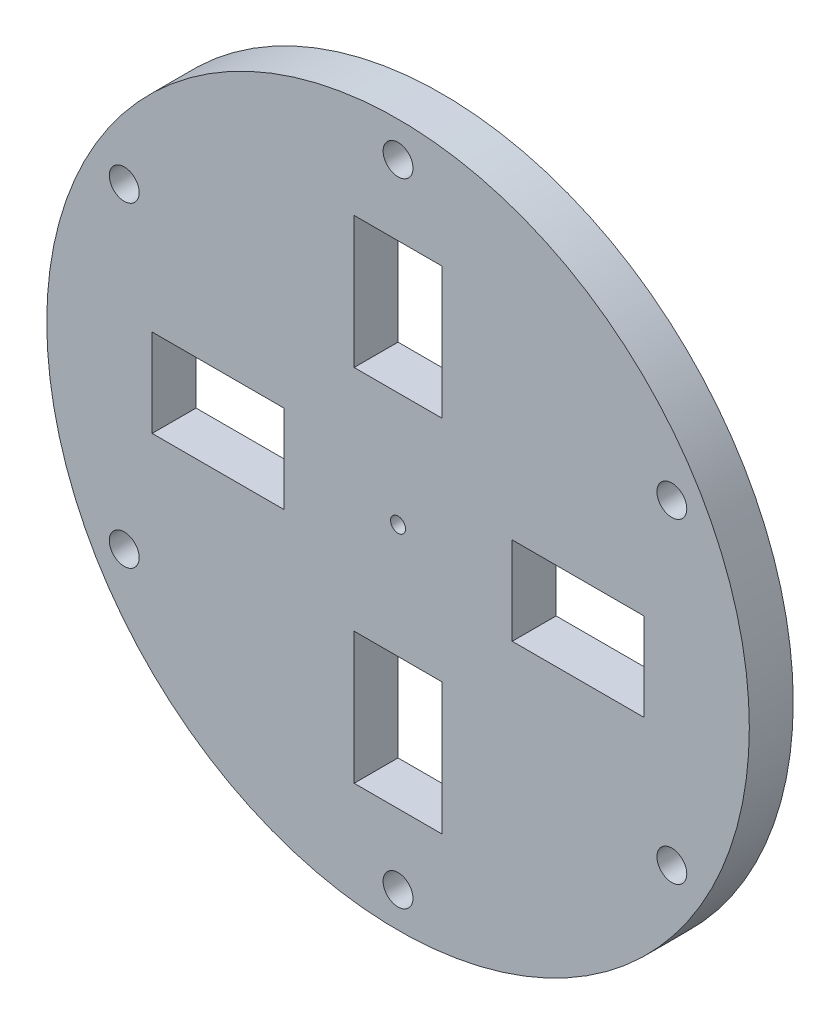
ISO-10303-21;
HEADER;
FILE_DESCRIPTION(('STEP AP214'),'2;1');
FILE_NAME('part.step','',(''),(''),'','','');
FILE_SCHEMA(('AUTOMOTIVE_DESIGN { 1 0 10303 214 1 1 1 1 }'));
ENDSEC;
DATA;
#1=APPLICATION_CONTEXT('core data for automotive mechanical design processes');
#2=APPLICATION_PROTOCOL_DEFINITION('international standard','automotive_design',2000,#1);
#3=PRODUCT_CONTEXT('',#1,'mechanical');
#4=PRODUCT('Part','Part','',(#3));
#5=PRODUCT_RELATED_PRODUCT_CATEGORY('part','',(#4));
#6=PRODUCT_DEFINITION_FORMATION('','',#4);
#7=PRODUCT_DEFINITION_CONTEXT('part definition',#1,'design');
#8=PRODUCT_DEFINITION('design','',#6,#7);
#9=PRODUCT_DEFINITION_SHAPE('','',#8);
#10=(LENGTH_UNIT() NAMED_UNIT(*) SI_UNIT(.MILLI.,.METRE.));
#11=(NAMED_UNIT(*) PLANE_ANGLE_UNIT() SI_UNIT($,.RADIAN.));
#12=(NAMED_UNIT(*) SI_UNIT($,.STERADIAN.) SOLID_ANGLE_UNIT());
#13=UNCERTAINTY_MEASURE_WITH_UNIT(LENGTH_MEASURE(1.E-05),#10,'distance_accuracy_value','');
#14=(GEOMETRIC_REPRESENTATION_CONTEXT(3) GLOBAL_UNCERTAINTY_ASSIGNED_CONTEXT((#13)) GLOBAL_UNIT_ASSIGNED_CONTEXT((#10,
#11,#12)) REPRESENTATION_CONTEXT('',''));
#15=CARTESIAN_POINT('',(0.,0.,0.));
#16=DIRECTION('',(0.,0.,1.));
#17=DIRECTION('',(1.,0.,0.));
#18=AXIS2_PLACEMENT_3D('',#15,#16,#17);
#19=CARTESIAN_POINT('',(0.,0.,5.));
#20=DIRECTION('',(0.,0.,1.));
#21=DIRECTION('',(1.,0.,0.));
#22=AXIS2_PLACEMENT_3D('',#19,#20,#21);
#23=PLANE('',#22);
#24=CARTESIAN_POINT('',(0.,0.,5.));
#25=DIRECTION('',(0.,0.,1.));
#26=DIRECTION('',(1.,0.,0.));
#27=AXIS2_PLACEMENT_3D('',#24,#25,#26);
#28=CIRCLE('',#27,0.85);
#29=CARTESIAN_POINT('',(0.85,0.,5.));
#30=VERTEX_POINT('',#29);
#31=EDGE_CURVE('E402',#30,#30,#28,.T.);
#32=ORIENTED_EDGE('',*,*,#31,.F.);
#33=EDGE_LOOP('',(#32));
#34=FACE_BOUND('',#33,.T.);
#35=CARTESIAN_POINT('',(-31.1769145362396,18.0000000000004,5.));
#36=DIRECTION('',(0.,0.,1.));
#37=DIRECTION('',(1.,0.,0.));
#38=AXIS2_PLACEMENT_3D('',#35,#36,#37);
#39=CIRCLE('',#38,1.7);
#40=CARTESIAN_POINT('',(-29.4769145362396,18.0000000000004,5.));
#41=VERTEX_POINT('',#40);
#42=EDGE_CURVE('E404',#41,#41,#39,.T.);
#43=ORIENTED_EDGE('',*,*,#42,.F.);
#44=EDGE_LOOP('',(#43));
#45=FACE_BOUND('',#44,.T.);
#46=CARTESIAN_POINT('',(-31.17691453624,-17.9999999999997,5.));
#47=DIRECTION('',(0.,0.,1.));
#48=DIRECTION('',(1.,0.,0.));
#49=AXIS2_PLACEMENT_3D('',#46,#47,#48);
#50=CIRCLE('',#49,1.7);
#51=CARTESIAN_POINT('',(-29.47691453624,-17.9999999999997,5.));
#52=VERTEX_POINT('',#51);
#53=EDGE_CURVE('E410',#52,#52,#50,.T.);
#54=ORIENTED_EDGE('',*,*,#53,.F.);
#55=EDGE_LOOP('',(#54));
#56=FACE_BOUND('',#55,.T.);
#57=CARTESIAN_POINT('',(-2.51386656396706E-13,-36.,5.));
#58=DIRECTION('',(0.,0.,1.));
#59=DIRECTION('',(1.,0.,0.));
#60=AXIS2_PLACEMENT_3D('',#57,#58,#59);
#61=CIRCLE('',#60,1.7);
#62=CARTESIAN_POINT('',(1.69999999999975,-36.,5.));
#63=VERTEX_POINT('',#62);
#64=EDGE_CURVE('E416',#63,#63,#61,.T.);
#65=ORIENTED_EDGE('',*,*,#64,.F.);
#66=EDGE_LOOP('',(#65));
#67=FACE_BOUND('',#66,.T.);
#68=CARTESIAN_POINT('',(31.1769145362397,-18.0000000000002,5.));
#69=DIRECTION('',(0.,0.,1.));
#70=DIRECTION('',(1.,0.,0.));
#71=AXIS2_PLACEMENT_3D('',#68,#69,#70);
#72=CIRCLE('',#71,1.7);
#73=CARTESIAN_POINT('',(32.8769145362397,-18.0000000000002,5.));
#74=VERTEX_POINT('',#73);
#75=EDGE_CURVE('E422',#74,#74,#72,.T.);
#76=ORIENTED_EDGE('',*,*,#75,.F.);
#77=EDGE_LOOP('',(#76));
#78=FACE_BOUND('',#77,.T.);
#79=CARTESIAN_POINT('',(31.1769145362398,17.9999999999999,5.));
#80=DIRECTION('',(0.,0.,1.));
#81=DIRECTION('',(1.,0.,0.));
#82=AXIS2_PLACEMENT_3D('',#79,#80,#81);
#83=CIRCLE('',#82,1.7);
#84=CARTESIAN_POINT('',(32.8769145362398,17.9999999999999,5.));
#85=VERTEX_POINT('',#84);
#86=EDGE_CURVE('E428',#85,#85,#83,.T.);
#87=ORIENTED_EDGE('',*,*,#86,.F.);
#88=EDGE_LOOP('',(#87));
#89=FACE_BOUND('',#88,.T.);
#90=CARTESIAN_POINT('',(0.,36.,5.));
#91=DIRECTION('',(0.,0.,1.));
#92=DIRECTION('',(1.,0.,0.));
#93=AXIS2_PLACEMENT_3D('',#90,#91,#92);
#94=CIRCLE('',#93,1.7);
#95=CARTESIAN_POINT('',(1.7,36.,5.));
#96=VERTEX_POINT('',#95);
#97=EDGE_CURVE('E169',#96,#96,#94,.T.);
#98=ORIENTED_EDGE('',*,*,#97,.F.);
#99=EDGE_LOOP('',(#98));
#100=FACE_BOUND('',#99,.T.);
#101=DIRECTION('',(-1.,0.,0.));
#102=VECTOR('',#101,1.);
#103=CARTESIAN_POINT('',(-28.0000000000008,4.99999999999942,5.));
#104=LINE('',#103,#102);
#105=CARTESIAN_POINT('',(-13.0000000000008,4.99999999999942,5.));
#106=VERTEX_POINT('',#105);
#107=CARTESIAN_POINT('',(-28.0000000000008,4.99999999999942,5.));
#108=VERTEX_POINT('',#107);
#109=EDGE_CURVE('E47',#106,#108,#104,.T.);
#110=ORIENTED_EDGE('',*,*,#109,.F.);
#111=DIRECTION('',(0.,1.,0.));
#112=VECTOR('',#111,1.);
#113=CARTESIAN_POINT('',(-13.0000000000008,-4.99999999999907,5.));
#114=LINE('',#113,#112);
#115=CARTESIAN_POINT('',(-13.0000000000008,-4.99999999999907,5.));
#116=VERTEX_POINT('',#115);
#117=EDGE_CURVE('E163',#116,#106,#114,.T.);
#118=ORIENTED_EDGE('',*,*,#117,.F.);
#119=DIRECTION('',(1.,1.00787433954252E-13,0.));
#120=VECTOR('',#119,1.);
#121=CARTESIAN_POINT('',(-28.0000000000008,-5.00000000000058,5.));
#122=LINE('',#121,#120);
#123=CARTESIAN_POINT('',(-28.0000000000008,-5.00000000000058,5.));
#124=VERTEX_POINT('',#123);
#125=EDGE_CURVE('E166',#124,#116,#122,.T.);
#126=ORIENTED_EDGE('',*,*,#125,.F.);
#127=DIRECTION('',(0.,-1.,0.));
#128=VECTOR('',#127,1.);
#129=CARTESIAN_POINT('',(-28.0000000000008,-5.00000000000058,5.));
#130=LINE('',#129,#128);
#131=EDGE_CURVE('E175',#108,#124,#130,.T.);
#132=ORIENTED_EDGE('',*,*,#131,.F.);
#133=EDGE_LOOP('',(#110,#118,#126,#132));
#134=FACE_BOUND('',#133,.T.);
#135=DIRECTION('',(0.,-1.,0.));
#136=VECTOR('',#135,1.);
#137=CARTESIAN_POINT('',(-5.00000000000018,-28.0000000000007,5.));
#138=LINE('',#137,#136);
#139=CARTESIAN_POINT('',(-5.00000000000018,-13.0000000000007,5.));
#140=VERTEX_POINT('',#139);
#141=CARTESIAN_POINT('',(-5.00000000000018,-28.0000000000007,5.));
#142=VERTEX_POINT('',#141);
#143=EDGE_CURVE('E182',#140,#142,#138,.T.);
#144=ORIENTED_EDGE('',*,*,#143,.F.);
#145=DIRECTION('',(-1.,0.,0.));
#146=VECTOR('',#145,1.);
#147=CARTESIAN_POINT('',(4.99999999999831,-13.0000000000007,5.));
#148=LINE('',#147,#146);
#149=CARTESIAN_POINT('',(4.99999999999831,-13.0000000000007,5.));
#150=VERTEX_POINT('',#149);
#151=EDGE_CURVE('E190',#150,#140,#148,.T.);
#152=ORIENTED_EDGE('',*,*,#151,.F.);
#153=DIRECTION('',(-1.0096090630185E-13,1.,0.));
#154=VECTOR('',#153,1.);
#155=CARTESIAN_POINT('',(4.99999999999982,-28.0000000000007,5.));
#156=LINE('',#155,#154);
#157=CARTESIAN_POINT('',(4.99999999999982,-28.0000000000007,5.));
#158=VERTEX_POINT('',#157);
#159=EDGE_CURVE('E204',#158,#150,#156,.T.);
#160=ORIENTED_EDGE('',*,*,#159,.F.);
#161=DIRECTION('',(1.,0.,0.));
#162=VECTOR('',#161,1.);
#163=CARTESIAN_POINT('',(4.99999999999982,-28.0000000000007,5.));
#164=LINE('',#163,#162);
#165=EDGE_CURVE('E201',#142,#158,#164,.T.);
#166=ORIENTED_EDGE('',*,*,#165,.F.);
#167=EDGE_LOOP('',(#144,#152,#160,#166));
#168=FACE_BOUND('',#167,.T.);
#169=DIRECTION('',(1.,0.,0.));
#170=VECTOR('',#169,1.);
#171=CARTESIAN_POINT('',(28.,-5.00000000000013,5.));
#172=LINE('',#171,#170);
#173=CARTESIAN_POINT('',(13.,-5.00000000000014,5.));
#174=VERTEX_POINT('',#173);
#175=CARTESIAN_POINT('',(28.,-5.00000000000013,5.));
#176=VERTEX_POINT('',#175);
#177=EDGE_CURVE('E211',#174,#176,#172,.T.);
#178=ORIENTED_EDGE('',*,*,#177,.F.);
#179=DIRECTION('',(0.,-1.,0.));
#180=VECTOR('',#179,1.);
#181=CARTESIAN_POINT('',(12.9999999999999,4.99999999999836,5.));
#182=LINE('',#181,#180);
#183=CARTESIAN_POINT('',(12.9999999999999,4.99999999999836,5.));
#184=VERTEX_POINT('',#183);
#185=EDGE_CURVE('E222',#184,#174,#182,.T.);
#186=ORIENTED_EDGE('',*,*,#185,.F.);
#187=DIRECTION('',(-1.,-1.00903082185984E-13,0.));
#188=VECTOR('',#187,1.);
#189=CARTESIAN_POINT('',(28.,4.99999999999987,5.));
#190=LINE('',#189,#188);
#191=CARTESIAN_POINT('',(28.,4.99999999999987,5.));
#192=VERTEX_POINT('',#191);
#193=EDGE_CURVE('E236',#192,#184,#190,.T.);
#194=ORIENTED_EDGE('',*,*,#193,.F.);
#195=DIRECTION('',(0.,1.,0.));
#196=VECTOR('',#195,1.);
#197=CARTESIAN_POINT('',(28.,4.99999999999987,5.));
#198=LINE('',#197,#196);
#199=EDGE_CURVE('E233',#176,#192,#198,.T.);
#200=ORIENTED_EDGE('',*,*,#199,.F.);
#201=EDGE_LOOP('',(#178,#186,#194,#200));
#202=FACE_BOUND('',#201,.T.);
#203=DIRECTION('',(0.,1.,0.));
#204=VECTOR('',#203,1.);
#205=CARTESIAN_POINT('',(4.99999999999937,28.,5.));
#206=LINE('',#205,#204);
#207=CARTESIAN_POINT('',(4.99999999999937,13.,5.));
#208=VERTEX_POINT('',#207);
#209=CARTESIAN_POINT('',(4.99999999999937,28.,5.));
#210=VERTEX_POINT('',#209);
#211=EDGE_CURVE('E243',#208,#210,#206,.T.);
#212=ORIENTED_EDGE('',*,*,#211,.F.);
#213=DIRECTION('',(1.,0.,0.));
#214=VECTOR('',#213,1.);
#215=CARTESIAN_POINT('',(-4.99999999999912,13.,5.));
#216=LINE('',#215,#214);
#217=CARTESIAN_POINT('',(-4.99999999999912,13.,5.));
#218=VERTEX_POINT('',#217);
#219=EDGE_CURVE('E254',#218,#208,#216,.T.);
#220=ORIENTED_EDGE('',*,*,#219,.F.);
#221=DIRECTION('',(1.00845258070118E-13,-1.,0.));
#222=VECTOR('',#221,1.);
#223=CARTESIAN_POINT('',(-5.00000000000063,28.,5.));
#224=LINE('',#223,#222);
#225=CARTESIAN_POINT('',(-5.00000000000063,28.,5.));
#226=VERTEX_POINT('',#225);
#227=EDGE_CURVE('E268',#226,#218,#224,.T.);
#228=ORIENTED_EDGE('',*,*,#227,.F.);
#229=DIRECTION('',(-1.,0.,0.));
#230=VECTOR('',#229,1.);
#231=CARTESIAN_POINT('',(-5.00000000000063,28.,5.));
#232=LINE('',#231,#230);
#233=EDGE_CURVE('E265',#210,#226,#232,.T.);
#234=ORIENTED_EDGE('',*,*,#233,.F.);
#235=EDGE_LOOP('',(#212,#220,#228,#234));
#236=FACE_BOUND('',#235,.T.);
#237=CARTESIAN_POINT('',(0.,0.,5.));
#238=DIRECTION('',(0.,0.,1.));
#239=DIRECTION('',(1.,0.,0.));
#240=AXIS2_PLACEMENT_3D('',#237,#238,#239);
#241=CIRCLE('',#240,40.);
#242=CARTESIAN_POINT('',(40.,0.,5.));
#243=VERTEX_POINT('',#242);
#244=EDGE_CURVE('E11',#243,#243,#241,.T.);
#245=ORIENTED_EDGE('',*,*,#244,.T.);
#246=EDGE_LOOP('',(#245));
#247=FACE_BOUND('',#246,.T.);
#248=ADVANCED_FACE('F32',(#34,#45,#56,#67,#78,#89,#100,#134,#168,#202,#236,#247),#23,.T.);
#249=CARTESIAN_POINT('',(0.,0.,0.));
#250=DIRECTION('',(0.,0.,1.));
#251=DIRECTION('',(1.,0.,0.));
#252=AXIS2_PLACEMENT_3D('',#249,#250,#251);
#253=PLANE('',#252);
#254=CARTESIAN_POINT('',(0.,0.,0.));
#255=DIRECTION('',(0.,0.,1.));
#256=DIRECTION('',(1.,0.,0.));
#257=AXIS2_PLACEMENT_3D('',#254,#255,#256);
#258=CIRCLE('',#257,0.85);
#259=CARTESIAN_POINT('',(0.85,0.,0.));
#260=VERTEX_POINT('',#259);
#261=EDGE_CURVE('E400',#260,#260,#258,.T.);
#262=ORIENTED_EDGE('',*,*,#261,.T.);
#263=EDGE_LOOP('',(#262));
#264=FACE_BOUND('',#263,.T.);
#265=CARTESIAN_POINT('',(-31.1769145362396,18.0000000000004,0.));
#266=DIRECTION('',(0.,0.,1.));
#267=DIRECTION('',(1.,0.,0.));
#268=AXIS2_PLACEMENT_3D('',#265,#266,#267);
#269=CIRCLE('',#268,1.7);
#270=CARTESIAN_POINT('',(-29.4769145362396,18.0000000000004,0.));
#271=VERTEX_POINT('',#270);
#272=EDGE_CURVE('E407',#271,#271,#269,.T.);
#273=ORIENTED_EDGE('',*,*,#272,.T.);
#274=EDGE_LOOP('',(#273));
#275=FACE_BOUND('',#274,.T.);
#276=CARTESIAN_POINT('',(-31.17691453624,-17.9999999999997,0.));
#277=DIRECTION('',(0.,0.,1.));
#278=DIRECTION('',(1.,0.,0.));
#279=AXIS2_PLACEMENT_3D('',#276,#277,#278);
#280=CIRCLE('',#279,1.7);
#281=CARTESIAN_POINT('',(-29.47691453624,-17.9999999999997,0.));
#282=VERTEX_POINT('',#281);
#283=EDGE_CURVE('E413',#282,#282,#280,.T.);
#284=ORIENTED_EDGE('',*,*,#283,.T.);
#285=EDGE_LOOP('',(#284));
#286=FACE_BOUND('',#285,.T.);
#287=CARTESIAN_POINT('',(-2.51386656396706E-13,-36.,0.));
#288=DIRECTION('',(0.,0.,1.));
#289=DIRECTION('',(1.,0.,0.));
#290=AXIS2_PLACEMENT_3D('',#287,#288,#289);
#291=CIRCLE('',#290,1.7);
#292=CARTESIAN_POINT('',(1.69999999999975,-36.,0.));
#293=VERTEX_POINT('',#292);
#294=EDGE_CURVE('E419',#293,#293,#291,.T.);
#295=ORIENTED_EDGE('',*,*,#294,.T.);
#296=EDGE_LOOP('',(#295));
#297=FACE_BOUND('',#296,.T.);
#298=CARTESIAN_POINT('',(31.1769145362397,-18.0000000000002,0.));
#299=DIRECTION('',(0.,0.,1.));
#300=DIRECTION('',(1.,0.,0.));
#301=AXIS2_PLACEMENT_3D('',#298,#299,#300);
#302=CIRCLE('',#301,1.7);
#303=CARTESIAN_POINT('',(32.8769145362397,-18.0000000000002,0.));
#304=VERTEX_POINT('',#303);
#305=EDGE_CURVE('E425',#304,#304,#302,.T.);
#306=ORIENTED_EDGE('',*,*,#305,.T.);
#307=EDGE_LOOP('',(#306));
#308=FACE_BOUND('',#307,.T.);
#309=CARTESIAN_POINT('',(31.1769145362398,17.9999999999999,0.));
#310=DIRECTION('',(0.,0.,1.));
#311=DIRECTION('',(1.,0.,0.));
#312=AXIS2_PLACEMENT_3D('',#309,#310,#311);
#313=CIRCLE('',#312,1.7);
#314=CARTESIAN_POINT('',(32.8769145362398,17.9999999999999,0.));
#315=VERTEX_POINT('',#314);
#316=EDGE_CURVE('E431',#315,#315,#313,.T.);
#317=ORIENTED_EDGE('',*,*,#316,.T.);
#318=EDGE_LOOP('',(#317));
#319=FACE_BOUND('',#318,.T.);
#320=CARTESIAN_POINT('',(0.,36.,0.));
#321=DIRECTION('',(0.,0.,1.));
#322=DIRECTION('',(1.,0.,0.));
#323=AXIS2_PLACEMENT_3D('',#320,#321,#322);
#324=CIRCLE('',#323,1.7);
#325=CARTESIAN_POINT('',(1.7,36.,0.));
#326=VERTEX_POINT('',#325);
#327=EDGE_CURVE('E176',#326,#326,#324,.T.);
#328=ORIENTED_EDGE('',*,*,#327,.T.);
#329=EDGE_LOOP('',(#328));
#330=FACE_BOUND('',#329,.T.);
#331=DIRECTION('',(0.,1.,0.));
#332=VECTOR('',#331,1.);
#333=CARTESIAN_POINT('',(-13.0000000000008,-4.99999999999907,0.));
#334=LINE('',#333,#332);
#335=CARTESIAN_POINT('',(-13.0000000000008,-4.99999999999907,0.));
#336=VERTEX_POINT('',#335);
#337=CARTESIAN_POINT('',(-13.0000000000008,4.99999999999942,0.));
#338=VERTEX_POINT('',#337);
#339=EDGE_CURVE('E153',#336,#338,#334,.T.);
#340=ORIENTED_EDGE('',*,*,#339,.T.);
#341=DIRECTION('',(-1.,0.,0.));
#342=VECTOR('',#341,1.);
#343=CARTESIAN_POINT('',(-28.0000000000008,4.99999999999942,0.));
#344=LINE('',#343,#342);
#345=CARTESIAN_POINT('',(-28.0000000000008,4.99999999999942,0.));
#346=VERTEX_POINT('',#345);
#347=EDGE_CURVE('E147',#338,#346,#344,.T.);
#348=ORIENTED_EDGE('',*,*,#347,.T.);
#349=DIRECTION('',(0.,-1.,0.));
#350=VECTOR('',#349,1.);
#351=CARTESIAN_POINT('',(-28.0000000000008,-5.00000000000058,0.));
#352=LINE('',#351,#350);
#353=CARTESIAN_POINT('',(-28.0000000000008,-5.00000000000058,0.));
#354=VERTEX_POINT('',#353);
#355=EDGE_CURVE('E156',#346,#354,#352,.T.);
#356=ORIENTED_EDGE('',*,*,#355,.T.);
#357=DIRECTION('',(1.,1.00787433954252E-13,0.));
#358=VECTOR('',#357,1.);
#359=CARTESIAN_POINT('',(-28.0000000000008,-5.00000000000058,0.));
#360=LINE('',#359,#358);
#361=EDGE_CURVE('E55',#354,#336,#360,.T.);
#362=ORIENTED_EDGE('',*,*,#361,.T.);
#363=EDGE_LOOP('',(#340,#348,#356,#362));
#364=FACE_BOUND('',#363,.T.);
#365=DIRECTION('',(-1.,0.,0.));
#366=VECTOR('',#365,1.);
#367=CARTESIAN_POINT('',(4.99999999999831,-13.0000000000007,0.));
#368=LINE('',#367,#366);
#369=CARTESIAN_POINT('',(4.99999999999831,-13.0000000000007,0.));
#370=VERTEX_POINT('',#369);
#371=CARTESIAN_POINT('',(-5.00000000000018,-13.0000000000007,0.));
#372=VERTEX_POINT('',#371);
#373=EDGE_CURVE('E196',#370,#372,#368,.T.);
#374=ORIENTED_EDGE('',*,*,#373,.T.);
#375=DIRECTION('',(0.,-1.,0.));
#376=VECTOR('',#375,1.);
#377=CARTESIAN_POINT('',(-5.00000000000018,-28.0000000000007,0.));
#378=LINE('',#377,#376);
#379=CARTESIAN_POINT('',(-5.00000000000018,-28.0000000000007,0.));
#380=VERTEX_POINT('',#379);
#381=EDGE_CURVE('E186',#372,#380,#378,.T.);
#382=ORIENTED_EDGE('',*,*,#381,.T.);
#383=DIRECTION('',(1.,0.,0.));
#384=VECTOR('',#383,1.);
#385=CARTESIAN_POINT('',(4.99999999999982,-28.0000000000007,0.));
#386=LINE('',#385,#384);
#387=CARTESIAN_POINT('',(4.99999999999982,-28.0000000000007,0.));
#388=VERTEX_POINT('',#387);
#389=EDGE_CURVE('E189',#380,#388,#386,.T.);
#390=ORIENTED_EDGE('',*,*,#389,.T.);
#391=DIRECTION('',(-1.0096090630185E-13,1.,0.));
#392=VECTOR('',#391,1.);
#393=CARTESIAN_POINT('',(4.99999999999982,-28.0000000000007,0.));
#394=LINE('',#393,#392);
#395=EDGE_CURVE('E193',#388,#370,#394,.T.);
#396=ORIENTED_EDGE('',*,*,#395,.T.);
#397=EDGE_LOOP('',(#374,#382,#390,#396));
#398=FACE_BOUND('',#397,.T.);
#399=DIRECTION('',(0.,-1.,0.));
#400=VECTOR('',#399,1.);
#401=CARTESIAN_POINT('',(12.9999999999999,4.99999999999836,0.));
#402=LINE('',#401,#400);
#403=CARTESIAN_POINT('',(12.9999999999999,4.99999999999836,0.));
#404=VERTEX_POINT('',#403);
#405=CARTESIAN_POINT('',(13.,-5.00000000000014,0.));
#406=VERTEX_POINT('',#405);
#407=EDGE_CURVE('E228',#404,#406,#402,.T.);
#408=ORIENTED_EDGE('',*,*,#407,.T.);
#409=DIRECTION('',(1.,0.,0.));
#410=VECTOR('',#409,1.);
#411=CARTESIAN_POINT('',(28.,-5.00000000000013,0.));
#412=LINE('',#411,#410);
#413=CARTESIAN_POINT('',(28.,-5.00000000000013,0.));
#414=VERTEX_POINT('',#413);
#415=EDGE_CURVE('E218',#406,#414,#412,.T.);
#416=ORIENTED_EDGE('',*,*,#415,.T.);
#417=DIRECTION('',(0.,1.,0.));
#418=VECTOR('',#417,1.);
#419=CARTESIAN_POINT('',(28.,4.99999999999987,0.));
#420=LINE('',#419,#418);
#421=CARTESIAN_POINT('',(28.,4.99999999999987,0.));
#422=VERTEX_POINT('',#421);
#423=EDGE_CURVE('E221',#414,#422,#420,.T.);
#424=ORIENTED_EDGE('',*,*,#423,.T.);
#425=DIRECTION('',(-1.,-1.00903082185984E-13,0.));
#426=VECTOR('',#425,1.);
#427=CARTESIAN_POINT('',(28.,4.99999999999987,0.));
#428=LINE('',#427,#426);
#429=EDGE_CURVE('E225',#422,#404,#428,.T.);
#430=ORIENTED_EDGE('',*,*,#429,.T.);
#431=EDGE_LOOP('',(#408,#416,#424,#430));
#432=FACE_BOUND('',#431,.T.);
#433=DIRECTION('',(1.,0.,0.));
#434=VECTOR('',#433,1.);
#435=CARTESIAN_POINT('',(-4.99999999999912,13.,0.));
#436=LINE('',#435,#434);
#437=CARTESIAN_POINT('',(-4.99999999999912,13.,0.));
#438=VERTEX_POINT('',#437);
#439=CARTESIAN_POINT('',(4.99999999999937,13.,0.));
#440=VERTEX_POINT('',#439);
#441=EDGE_CURVE('E260',#438,#440,#436,.T.);
#442=ORIENTED_EDGE('',*,*,#441,.T.);
#443=DIRECTION('',(0.,1.,0.));
#444=VECTOR('',#443,1.);
#445=CARTESIAN_POINT('',(4.99999999999937,28.,0.));
#446=LINE('',#445,#444);
#447=CARTESIAN_POINT('',(4.99999999999937,28.,0.));
#448=VERTEX_POINT('',#447);
#449=EDGE_CURVE('E250',#440,#448,#446,.T.);
#450=ORIENTED_EDGE('',*,*,#449,.T.);
#451=DIRECTION('',(-1.,0.,0.));
#452=VECTOR('',#451,1.);
#453=CARTESIAN_POINT('',(-5.00000000000063,28.,0.));
#454=LINE('',#453,#452);
#455=CARTESIAN_POINT('',(-5.00000000000063,28.,0.));
#456=VERTEX_POINT('',#455);
#457=EDGE_CURVE('E253',#448,#456,#454,.T.);
#458=ORIENTED_EDGE('',*,*,#457,.T.);
#459=DIRECTION('',(1.00845258070118E-13,-1.,0.));
#460=VECTOR('',#459,1.);
#461=CARTESIAN_POINT('',(-5.00000000000063,28.,0.));
#462=LINE('',#461,#460);
#463=EDGE_CURVE('E257',#456,#438,#462,.T.);
#464=ORIENTED_EDGE('',*,*,#463,.T.);
#465=EDGE_LOOP('',(#442,#450,#458,#464));
#466=FACE_BOUND('',#465,.T.);
#467=CARTESIAN_POINT('',(0.,0.,0.));
#468=DIRECTION('',(0.,0.,1.));
#469=DIRECTION('',(1.,0.,0.));
#470=AXIS2_PLACEMENT_3D('',#467,#468,#469);
#471=CIRCLE('',#470,40.);
#472=CARTESIAN_POINT('',(40.,0.,0.));
#473=VERTEX_POINT('',#472);
#474=EDGE_CURVE('E36',#473,#473,#471,.T.);
#475=ORIENTED_EDGE('',*,*,#474,.F.);
#476=EDGE_LOOP('',(#475));
#477=FACE_BOUND('',#476,.T.);
#478=ADVANCED_FACE('F160',(#264,#275,#286,#297,#308,#319,#330,#364,#398,#432,#466,#477),#253,.F.);
#479=CARTESIAN_POINT('',(0.,0.,5.));
#480=DIRECTION('',(0.,0.,-1.));
#481=DIRECTION('',(-1.,0.,0.));
#482=AXIS2_PLACEMENT_3D('',#479,#480,#481);
#483=CYLINDRICAL_SURFACE('',#482,40.);
#484=ORIENTED_EDGE('',*,*,#244,.F.);
#485=EDGE_LOOP('',(#484));
#486=FACE_BOUND('',#485,.T.);
#487=ORIENTED_EDGE('',*,*,#474,.T.);
#488=EDGE_LOOP('',(#487));
#489=FACE_BOUND('',#488,.T.);
#490=ADVANCED_FACE('F34',(#486,#489),#483,.T.);
#491=CARTESIAN_POINT('',(4.99999999999937,28.,0.));
#492=DIRECTION('',(1.,0.,0.));
#493=DIRECTION('',(0.,1.,0.));
#494=AXIS2_PLACEMENT_3D('',#491,#492,#493);
#495=PLANE('',#494);
#496=ORIENTED_EDGE('',*,*,#211,.T.);
#497=DIRECTION('',(0.,0.,1.));
#498=VECTOR('',#497,1.);
#499=CARTESIAN_POINT('',(4.99999999999937,28.,0.));
#500=LINE('',#499,#498);
#501=EDGE_CURVE('E263',#448,#210,#500,.T.);
#502=ORIENTED_EDGE('',*,*,#501,.F.);
#503=ORIENTED_EDGE('',*,*,#449,.F.);
#504=DIRECTION('',(0.,0.,1.));
#505=VECTOR('',#504,1.);
#506=CARTESIAN_POINT('',(4.99999999999937,13.,0.));
#507=LINE('',#506,#505);
#508=EDGE_CURVE('E273',#440,#208,#507,.T.);
#509=ORIENTED_EDGE('',*,*,#508,.T.);
#510=EDGE_LOOP('',(#496,#502,#503,#509));
#511=FACE_BOUND('',#510,.T.);
#512=ADVANCED_FACE('F297',(#511),#495,.F.);
#513=CARTESIAN_POINT('',(-4.99999999999912,13.,0.));
#514=DIRECTION('',(0.,-1.,0.));
#515=DIRECTION('',(1.,0.,0.));
#516=AXIS2_PLACEMENT_3D('',#513,#514,#515);
#517=PLANE('',#516);
#518=ORIENTED_EDGE('',*,*,#219,.T.);
#519=ORIENTED_EDGE('',*,*,#508,.F.);
#520=ORIENTED_EDGE('',*,*,#441,.F.);
#521=DIRECTION('',(0.,0.,1.));
#522=VECTOR('',#521,1.);
#523=CARTESIAN_POINT('',(-4.99999999999912,13.,0.));
#524=LINE('',#523,#522);
#525=EDGE_CURVE('E275',#438,#218,#524,.T.);
#526=ORIENTED_EDGE('',*,*,#525,.T.);
#527=EDGE_LOOP('',(#518,#519,#520,#526));
#528=FACE_BOUND('',#527,.T.);
#529=ADVANCED_FACE('F299',(#528),#517,.F.);
#530=CARTESIAN_POINT('',(-5.00000000000063,28.,0.));
#531=DIRECTION('',(-1.,-1.00845258070118E-13,0.));
#532=DIRECTION('',(1.00845258070118E-13,-1.,0.));
#533=AXIS2_PLACEMENT_3D('',#530,#531,#532);
#534=PLANE('',#533);
#535=ORIENTED_EDGE('',*,*,#227,.T.);
#536=ORIENTED_EDGE('',*,*,#525,.F.);
#537=ORIENTED_EDGE('',*,*,#463,.F.);
#538=DIRECTION('',(0.,0.,1.));
#539=VECTOR('',#538,1.);
#540=CARTESIAN_POINT('',(-5.00000000000063,28.,0.));
#541=LINE('',#540,#539);
#542=EDGE_CURVE('E277',#456,#226,#541,.T.);
#543=ORIENTED_EDGE('',*,*,#542,.T.);
#544=EDGE_LOOP('',(#535,#536,#537,#543));
#545=FACE_BOUND('',#544,.T.);
#546=ADVANCED_FACE('F293',(#545),#534,.F.);
#547=CARTESIAN_POINT('',(-5.00000000000063,28.,0.));
#548=DIRECTION('',(0.,1.,0.));
#549=DIRECTION('',(0.,0.,1.));
#550=AXIS2_PLACEMENT_3D('',#547,#548,#549);
#551=PLANE('',#550);
#552=ORIENTED_EDGE('',*,*,#233,.T.);
#553=ORIENTED_EDGE('',*,*,#542,.F.);
#554=ORIENTED_EDGE('',*,*,#457,.F.);
#555=ORIENTED_EDGE('',*,*,#501,.T.);
#556=EDGE_LOOP('',(#552,#553,#554,#555));
#557=FACE_BOUND('',#556,.T.);
#558=ADVANCED_FACE('F283',(#557),#551,.F.);
#559=CARTESIAN_POINT('',(28.,-5.00000000000013,0.));
#560=DIRECTION('',(0.,-1.,0.));
#561=DIRECTION('',(1.,0.,0.));
#562=AXIS2_PLACEMENT_3D('',#559,#560,#561);
#563=PLANE('',#562);
#564=ORIENTED_EDGE('',*,*,#177,.T.);
#565=DIRECTION('',(0.,0.,1.));
#566=VECTOR('',#565,1.);
#567=CARTESIAN_POINT('',(28.,-5.00000000000013,0.));
#568=LINE('',#567,#566);
#569=EDGE_CURVE('E231',#414,#176,#568,.T.);
#570=ORIENTED_EDGE('',*,*,#569,.F.);
#571=ORIENTED_EDGE('',*,*,#415,.F.);
#572=DIRECTION('',(0.,0.,1.));
#573=VECTOR('',#572,1.);
#574=CARTESIAN_POINT('',(13.,-5.00000000000014,0.));
#575=LINE('',#574,#573);
#576=EDGE_CURVE('E241',#406,#174,#575,.T.);
#577=ORIENTED_EDGE('',*,*,#576,.T.);
#578=EDGE_LOOP('',(#564,#570,#571,#577));
#579=FACE_BOUND('',#578,.T.);
#580=ADVANCED_FACE('F321',(#579),#563,.F.);
#581=CARTESIAN_POINT('',(12.9999999999999,4.99999999999836,0.));
#582=DIRECTION('',(-1.,0.,0.));
#583=DIRECTION('',(0.,-1.,0.));
#584=AXIS2_PLACEMENT_3D('',#581,#582,#583);
#585=PLANE('',#584);
#586=ORIENTED_EDGE('',*,*,#185,.T.);
#587=ORIENTED_EDGE('',*,*,#576,.F.);
#588=ORIENTED_EDGE('',*,*,#407,.F.);
#589=DIRECTION('',(0.,0.,1.));
#590=VECTOR('',#589,1.);
#591=CARTESIAN_POINT('',(12.9999999999999,4.99999999999836,0.));
#592=LINE('',#591,#590);
#593=EDGE_CURVE('E244',#404,#184,#592,.T.);
#594=ORIENTED_EDGE('',*,*,#593,.T.);
#595=EDGE_LOOP('',(#586,#587,#588,#594));
#596=FACE_BOUND('',#595,.T.);
#597=ADVANCED_FACE('F325',(#596),#585,.F.);
#598=CARTESIAN_POINT('',(28.,4.99999999999987,0.));
#599=DIRECTION('',(-1.00903082185984E-13,1.,0.));
#600=DIRECTION('',(-1.,-1.00903082185984E-13,0.));
#601=AXIS2_PLACEMENT_3D('',#598,#599,#600);
#602=PLANE('',#601);
#603=ORIENTED_EDGE('',*,*,#193,.T.);
#604=ORIENTED_EDGE('',*,*,#593,.F.);
#605=ORIENTED_EDGE('',*,*,#429,.F.);
#606=DIRECTION('',(0.,0.,1.));
#607=VECTOR('',#606,1.);
#608=CARTESIAN_POINT('',(28.,4.99999999999987,0.));
#609=LINE('',#608,#607);
#610=EDGE_CURVE('E246',#422,#192,#609,.T.);
#611=ORIENTED_EDGE('',*,*,#610,.T.);
#612=EDGE_LOOP('',(#603,#604,#605,#611));
#613=FACE_BOUND('',#612,.T.);
#614=ADVANCED_FACE('F330',(#613),#602,.F.);
#615=CARTESIAN_POINT('',(28.,4.99999999999987,0.));
#616=DIRECTION('',(1.,0.,0.));
#617=DIRECTION('',(0.,0.,-1.));
#618=AXIS2_PLACEMENT_3D('',#615,#616,#617);
#619=PLANE('',#618);
#620=ORIENTED_EDGE('',*,*,#199,.T.);
#621=ORIENTED_EDGE('',*,*,#610,.F.);
#622=ORIENTED_EDGE('',*,*,#423,.F.);
#623=ORIENTED_EDGE('',*,*,#569,.T.);
#624=EDGE_LOOP('',(#620,#621,#622,#623));
#625=FACE_BOUND('',#624,.T.);
#626=ADVANCED_FACE('F334',(#625),#619,.F.);
#627=CARTESIAN_POINT('',(-5.00000000000018,-28.0000000000007,0.));
#628=DIRECTION('',(-1.,0.,0.));
#629=DIRECTION('',(0.,-1.,0.));
#630=AXIS2_PLACEMENT_3D('',#627,#628,#629);
#631=PLANE('',#630);
#632=ORIENTED_EDGE('',*,*,#143,.T.);
#633=DIRECTION('',(0.,0.,1.));
#634=VECTOR('',#633,1.);
#635=CARTESIAN_POINT('',(-5.00000000000018,-28.0000000000007,0.));
#636=LINE('',#635,#634);
#637=EDGE_CURVE('E199',#380,#142,#636,.T.);
#638=ORIENTED_EDGE('',*,*,#637,.F.);
#639=ORIENTED_EDGE('',*,*,#381,.F.);
#640=DIRECTION('',(0.,0.,1.));
#641=VECTOR('',#640,1.);
#642=CARTESIAN_POINT('',(-5.00000000000018,-13.0000000000007,0.));
#643=LINE('',#642,#641);
#644=EDGE_CURVE('E209',#372,#140,#643,.T.);
#645=ORIENTED_EDGE('',*,*,#644,.T.);
#646=EDGE_LOOP('',(#632,#638,#639,#645));
#647=FACE_BOUND('',#646,.T.);
#648=ADVANCED_FACE('F337',(#647),#631,.F.);
#649=CARTESIAN_POINT('',(4.99999999999831,-13.0000000000007,0.));
#650=DIRECTION('',(0.,1.,0.));
#651=DIRECTION('',(-1.,0.,0.));
#652=AXIS2_PLACEMENT_3D('',#649,#650,#651);
#653=PLANE('',#652);
#654=ORIENTED_EDGE('',*,*,#151,.T.);
#655=ORIENTED_EDGE('',*,*,#644,.F.);
#656=ORIENTED_EDGE('',*,*,#373,.F.);
#657=DIRECTION('',(0.,0.,1.));
#658=VECTOR('',#657,1.);
#659=CARTESIAN_POINT('',(4.99999999999831,-13.0000000000007,0.));
#660=LINE('',#659,#658);
#661=EDGE_CURVE('E212',#370,#150,#660,.T.);
#662=ORIENTED_EDGE('',*,*,#661,.T.);
#663=EDGE_LOOP('',(#654,#655,#656,#662));
#664=FACE_BOUND('',#663,.T.);
#665=ADVANCED_FACE('F344',(#664),#653,.F.);
#666=CARTESIAN_POINT('',(4.99999999999982,-28.0000000000007,0.));
#667=DIRECTION('',(1.,1.0096090630185E-13,0.));
#668=DIRECTION('',(-1.0096090630185E-13,1.,0.));
#669=AXIS2_PLACEMENT_3D('',#666,#667,#668);
#670=PLANE('',#669);
#671=ORIENTED_EDGE('',*,*,#159,.T.);
#672=ORIENTED_EDGE('',*,*,#661,.F.);
#673=ORIENTED_EDGE('',*,*,#395,.F.);
#674=DIRECTION('',(0.,0.,1.));
#675=VECTOR('',#674,1.);
#676=CARTESIAN_POINT('',(4.99999999999982,-28.0000000000007,0.));
#677=LINE('',#676,#675);
#678=EDGE_CURVE('E214',#388,#158,#677,.T.);
#679=ORIENTED_EDGE('',*,*,#678,.T.);
#680=EDGE_LOOP('',(#671,#672,#673,#679));
#681=FACE_BOUND('',#680,.T.);
#682=ADVANCED_FACE('F349',(#681),#670,.F.);
#683=CARTESIAN_POINT('',(4.99999999999982,-28.0000000000007,0.));
#684=DIRECTION('',(0.,-1.,0.));
#685=DIRECTION('',(0.,0.,-1.));
#686=AXIS2_PLACEMENT_3D('',#683,#684,#685);
#687=PLANE('',#686);
#688=ORIENTED_EDGE('',*,*,#165,.T.);
#689=ORIENTED_EDGE('',*,*,#678,.F.);
#690=ORIENTED_EDGE('',*,*,#389,.F.);
#691=ORIENTED_EDGE('',*,*,#637,.T.);
#692=EDGE_LOOP('',(#688,#689,#690,#691));
#693=FACE_BOUND('',#692,.T.);
#694=ADVANCED_FACE('F346',(#693),#687,.F.);
#695=CARTESIAN_POINT('',(-28.0000000000008,4.99999999999942,0.));
#696=DIRECTION('',(0.,1.,0.));
#697=DIRECTION('',(-1.,0.,0.));
#698=AXIS2_PLACEMENT_3D('',#695,#696,#697);
#699=PLANE('',#698);
#700=ORIENTED_EDGE('',*,*,#109,.T.);
#701=DIRECTION('',(0.,0.,1.));
#702=VECTOR('',#701,1.);
#703=CARTESIAN_POINT('',(-28.0000000000008,4.99999999999942,0.));
#704=LINE('',#703,#702);
#705=EDGE_CURVE('E143',#346,#108,#704,.T.);
#706=ORIENTED_EDGE('',*,*,#705,.F.);
#707=ORIENTED_EDGE('',*,*,#347,.F.);
#708=DIRECTION('',(0.,0.,1.));
#709=VECTOR('',#708,1.);
#710=CARTESIAN_POINT('',(-13.0000000000008,4.99999999999942,0.));
#711=LINE('',#710,#709);
#712=EDGE_CURVE('E180',#338,#106,#711,.T.);
#713=ORIENTED_EDGE('',*,*,#712,.T.);
#714=EDGE_LOOP('',(#700,#706,#707,#713));
#715=FACE_BOUND('',#714,.T.);
#716=ADVANCED_FACE('F145',(#715),#699,.F.);
#717=CARTESIAN_POINT('',(-13.0000000000008,-4.99999999999907,0.));
#718=DIRECTION('',(1.,0.,0.));
#719=DIRECTION('',(0.,1.,0.));
#720=AXIS2_PLACEMENT_3D('',#717,#718,#719);
#721=PLANE('',#720);
#722=ORIENTED_EDGE('',*,*,#117,.T.);
#723=ORIENTED_EDGE('',*,*,#712,.F.);
#724=ORIENTED_EDGE('',*,*,#339,.F.);
#725=DIRECTION('',(0.,0.,1.));
#726=VECTOR('',#725,1.);
#727=CARTESIAN_POINT('',(-13.0000000000008,-4.99999999999907,0.));
#728=LINE('',#727,#726);
#729=EDGE_CURVE('E183',#336,#116,#728,.T.);
#730=ORIENTED_EDGE('',*,*,#729,.T.);
#731=EDGE_LOOP('',(#722,#723,#724,#730));
#732=FACE_BOUND('',#731,.T.);
#733=ADVANCED_FACE('F359',(#732),#721,.F.);
#734=CARTESIAN_POINT('',(-28.0000000000008,-5.00000000000058,0.));
#735=DIRECTION('',(1.00787433954252E-13,-1.,0.));
#736=DIRECTION('',(1.,1.00787433954252E-13,0.));
#737=AXIS2_PLACEMENT_3D('',#734,#735,#736);
#738=PLANE('',#737);
#739=ORIENTED_EDGE('',*,*,#125,.T.);
#740=ORIENTED_EDGE('',*,*,#729,.F.);
#741=ORIENTED_EDGE('',*,*,#361,.F.);
#742=DIRECTION('',(0.,0.,1.));
#743=VECTOR('',#742,1.);
#744=CARTESIAN_POINT('',(-28.0000000000008,-5.00000000000058,0.));
#745=LINE('',#744,#743);
#746=EDGE_CURVE('E152',#354,#124,#745,.T.);
#747=ORIENTED_EDGE('',*,*,#746,.T.);
#748=EDGE_LOOP('',(#739,#740,#741,#747));
#749=FACE_BOUND('',#748,.T.);
#750=ADVANCED_FACE('F363',(#749),#738,.F.);
#751=CARTESIAN_POINT('',(-28.0000000000008,-5.00000000000058,0.));
#752=DIRECTION('',(-1.,0.,0.));
#753=DIRECTION('',(0.,0.,1.));
#754=AXIS2_PLACEMENT_3D('',#751,#752,#753);
#755=PLANE('',#754);
#756=ORIENTED_EDGE('',*,*,#131,.T.);
#757=ORIENTED_EDGE('',*,*,#746,.F.);
#758=ORIENTED_EDGE('',*,*,#355,.F.);
#759=ORIENTED_EDGE('',*,*,#705,.T.);
#760=EDGE_LOOP('',(#756,#757,#758,#759));
#761=FACE_BOUND('',#760,.T.);
#762=ADVANCED_FACE('F157',(#761),#755,.F.);
#763=CARTESIAN_POINT('',(0.,36.,0.));
#764=DIRECTION('',(0.,0.,1.));
#765=DIRECTION('',(1.,0.,0.));
#766=AXIS2_PLACEMENT_3D('',#763,#764,#765);
#767=CYLINDRICAL_SURFACE('',#766,1.7);
#768=ORIENTED_EDGE('',*,*,#327,.F.);
#769=EDGE_LOOP('',(#768));
#770=FACE_BOUND('',#769,.T.);
#771=ORIENTED_EDGE('',*,*,#97,.T.);
#772=EDGE_LOOP('',(#771));
#773=FACE_BOUND('',#772,.T.);
#774=ADVANCED_FACE('F362',(#770,#773),#767,.F.);
#775=CARTESIAN_POINT('',(31.1769145362398,17.9999999999999,0.));
#776=DIRECTION('',(0.,0.,1.));
#777=DIRECTION('',(1.,0.,0.));
#778=AXIS2_PLACEMENT_3D('',#775,#776,#777);
#779=CYLINDRICAL_SURFACE('',#778,1.7);
#780=ORIENTED_EDGE('',*,*,#316,.F.);
#781=EDGE_LOOP('',(#780));
#782=FACE_BOUND('',#781,.T.);
#783=ORIENTED_EDGE('',*,*,#86,.T.);
#784=EDGE_LOOP('',(#783));
#785=FACE_BOUND('',#784,.T.);
#786=ADVANCED_FACE('F371',(#782,#785),#779,.F.);
#787=CARTESIAN_POINT('',(31.1769145362397,-18.0000000000002,0.));
#788=DIRECTION('',(0.,0.,1.));
#789=DIRECTION('',(1.,0.,0.));
#790=AXIS2_PLACEMENT_3D('',#787,#788,#789);
#791=CYLINDRICAL_SURFACE('',#790,1.7);
#792=ORIENTED_EDGE('',*,*,#305,.F.);
#793=EDGE_LOOP('',(#792));
#794=FACE_BOUND('',#793,.T.);
#795=ORIENTED_EDGE('',*,*,#75,.T.);
#796=EDGE_LOOP('',(#795));
#797=FACE_BOUND('',#796,.T.);
#798=ADVANCED_FACE('F375',(#794,#797),#791,.F.);
#799=CARTESIAN_POINT('',(-2.51386656396706E-13,-36.,0.));
#800=DIRECTION('',(0.,0.,1.));
#801=DIRECTION('',(1.,0.,0.));
#802=AXIS2_PLACEMENT_3D('',#799,#800,#801);
#803=CYLINDRICAL_SURFACE('',#802,1.7);
#804=ORIENTED_EDGE('',*,*,#294,.F.);
#805=EDGE_LOOP('',(#804));
#806=FACE_BOUND('',#805,.T.);
#807=ORIENTED_EDGE('',*,*,#64,.T.);
#808=EDGE_LOOP('',(#807));
#809=FACE_BOUND('',#808,.T.);
#810=ADVANCED_FACE('F379',(#806,#809),#803,.F.);
#811=CARTESIAN_POINT('',(-31.17691453624,-17.9999999999997,0.));
#812=DIRECTION('',(0.,0.,1.));
#813=DIRECTION('',(1.,0.,0.));
#814=AXIS2_PLACEMENT_3D('',#811,#812,#813);
#815=CYLINDRICAL_SURFACE('',#814,1.7);
#816=ORIENTED_EDGE('',*,*,#283,.F.);
#817=EDGE_LOOP('',(#816));
#818=FACE_BOUND('',#817,.T.);
#819=ORIENTED_EDGE('',*,*,#53,.T.);
#820=EDGE_LOOP('',(#819));
#821=FACE_BOUND('',#820,.T.);
#822=ADVANCED_FACE('F383',(#818,#821),#815,.F.);
#823=CARTESIAN_POINT('',(-31.1769145362396,18.0000000000004,0.));
#824=DIRECTION('',(0.,0.,1.));
#825=DIRECTION('',(1.,0.,0.));
#826=AXIS2_PLACEMENT_3D('',#823,#824,#825);
#827=CYLINDRICAL_SURFACE('',#826,1.7);
#828=ORIENTED_EDGE('',*,*,#272,.F.);
#829=EDGE_LOOP('',(#828));
#830=FACE_BOUND('',#829,.T.);
#831=ORIENTED_EDGE('',*,*,#42,.T.);
#832=EDGE_LOOP('',(#831));
#833=FACE_BOUND('',#832,.T.);
#834=ADVANCED_FACE('F387',(#830,#833),#827,.F.);
#835=CARTESIAN_POINT('',(0.,0.,0.));
#836=DIRECTION('',(0.,0.,1.));
#837=DIRECTION('',(1.,0.,0.));
#838=AXIS2_PLACEMENT_3D('',#835,#836,#837);
#839=CYLINDRICAL_SURFACE('',#838,0.85);
#840=ORIENTED_EDGE('',*,*,#261,.F.);
#841=EDGE_LOOP('',(#840));
#842=FACE_BOUND('',#841,.T.);
#843=ORIENTED_EDGE('',*,*,#31,.T.);
#844=EDGE_LOOP('',(#843));
#845=FACE_BOUND('',#844,.T.);
#846=ADVANCED_FACE('F391',(#842,#845),#839,.F.);
#847=CLOSED_SHELL('',(#248,#478,#490,#512,#529,#546,#558,#580,#597,#614,#626,#648,#665,#682,
#694,#716,#733,#750,#762,#774,#786,#798,#810,#822,#834,#846));
#848=MANIFOLD_SOLID_BREP('B2',#847);
#849=ADVANCED_BREP_SHAPE_REPRESENTATION('',(#18,#848),#14);
#850=SHAPE_DEFINITION_REPRESENTATION(#9,#849);
ENDSEC;
END-ISO-10303-21;
